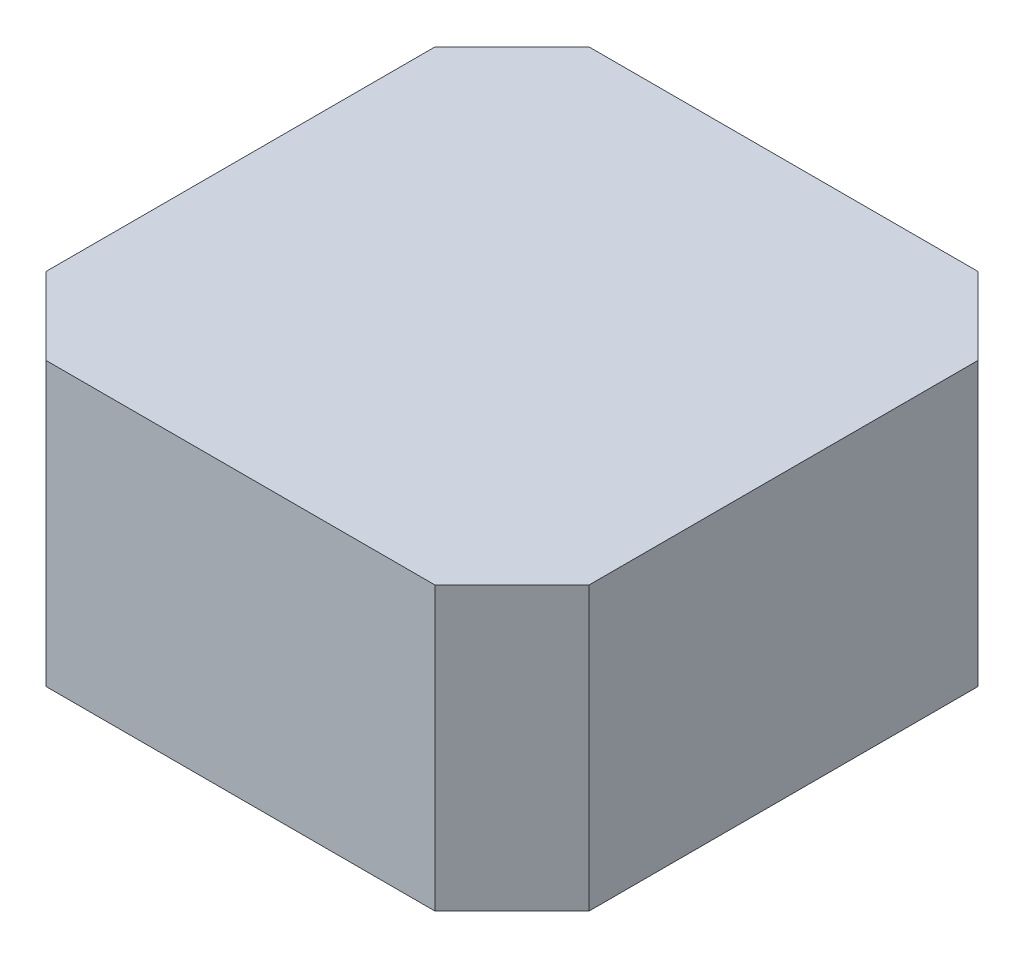
ISO-10303-21;
HEADER;
FILE_DESCRIPTION(('STEP AP214'),'2;1');
FILE_NAME('part.step','',(''),(''),'','','');
FILE_SCHEMA(('AUTOMOTIVE_DESIGN { 1 0 10303 214 1 1 1 1 }'));
ENDSEC;
DATA;
#1=APPLICATION_CONTEXT('core data for automotive mechanical design processes');
#2=APPLICATION_PROTOCOL_DEFINITION('international standard','automotive_design',2000,#1);
#3=PRODUCT_CONTEXT('',#1,'mechanical');
#4=PRODUCT('Part','Part','',(#3));
#5=PRODUCT_RELATED_PRODUCT_CATEGORY('part','',(#4));
#6=PRODUCT_DEFINITION_FORMATION('','',#4);
#7=PRODUCT_DEFINITION_CONTEXT('part definition',#1,'design');
#8=PRODUCT_DEFINITION('design','',#6,#7);
#9=PRODUCT_DEFINITION_SHAPE('','',#8);
#10=(LENGTH_UNIT() NAMED_UNIT(*) SI_UNIT(.MILLI.,.METRE.));
#11=(NAMED_UNIT(*) PLANE_ANGLE_UNIT() SI_UNIT($,.RADIAN.));
#12=(NAMED_UNIT(*) SI_UNIT($,.STERADIAN.) SOLID_ANGLE_UNIT());
#13=UNCERTAINTY_MEASURE_WITH_UNIT(LENGTH_MEASURE(1.E-05),#10,'distance_accuracy_value','');
#14=(GEOMETRIC_REPRESENTATION_CONTEXT(3) GLOBAL_UNCERTAINTY_ASSIGNED_CONTEXT((#13)) GLOBAL_UNIT_ASSIGNED_CONTEXT((#10,
#11,#12)) REPRESENTATION_CONTEXT('',''));
#15=CARTESIAN_POINT('',(0.,0.,0.));
#16=DIRECTION('',(0.,0.,1.));
#17=DIRECTION('',(1.,0.,0.));
#18=AXIS2_PLACEMENT_3D('',#15,#16,#17);
#19=CARTESIAN_POINT('',(0.,31.,0.));
#20=DIRECTION('',(0.,-1.,0.));
#21=DIRECTION('',(0.,0.,-1.));
#22=AXIS2_PLACEMENT_3D('',#19,#20,#21);
#23=PLANE('',#22);
#24=DIRECTION('',(0.707106781186548,0.,-0.707106781186548));
#25=VECTOR('',#24,1.);
#26=CARTESIAN_POINT('',(16.65,31.,19.65));
#27=LINE('',#26,#25);
#28=CARTESIAN_POINT('',(15.15,31.,21.15));
#29=VERTEX_POINT('',#28);
#30=CARTESIAN_POINT('',(21.15,31.,15.15));
#31=VERTEX_POINT('',#30);
#32=EDGE_CURVE('E144',#29,#31,#27,.T.);
#33=ORIENTED_EDGE('',*,*,#32,.T.);
#34=DIRECTION('',(0.,0.,-1.));
#35=VECTOR('',#34,1.);
#36=CARTESIAN_POINT('',(21.15,31.,7.575));
#37=LINE('',#36,#35);
#38=CARTESIAN_POINT('',(21.15,31.,-15.15));
#39=VERTEX_POINT('',#38);
#40=EDGE_CURVE('E138',#31,#39,#37,.T.);
#41=ORIENTED_EDGE('',*,*,#40,.T.);
#42=DIRECTION('',(-0.707106781186548,0.,-0.707106781186548));
#43=VECTOR('',#42,1.);
#44=CARTESIAN_POINT('',(19.65,31.,-16.65));
#45=LINE('',#44,#43);
#46=CARTESIAN_POINT('',(15.15,31.,-21.15));
#47=VERTEX_POINT('',#46);
#48=EDGE_CURVE('E119',#39,#47,#45,.T.);
#49=ORIENTED_EDGE('',*,*,#48,.T.);
#50=DIRECTION('',(-1.,0.,0.));
#51=VECTOR('',#50,1.);
#52=CARTESIAN_POINT('',(7.575,31.,-21.15));
#53=LINE('',#52,#51);
#54=CARTESIAN_POINT('',(-15.15,31.,-21.15));
#55=VERTEX_POINT('',#54);
#56=EDGE_CURVE('E115',#47,#55,#53,.T.);
#57=ORIENTED_EDGE('',*,*,#56,.T.);
#58=DIRECTION('',(-0.707106781186548,0.,0.707106781186548));
#59=VECTOR('',#58,1.);
#60=CARTESIAN_POINT('',(-16.65,31.,-19.65));
#61=LINE('',#60,#59);
#62=CARTESIAN_POINT('',(-21.15,31.,-15.15));
#63=VERTEX_POINT('',#62);
#64=EDGE_CURVE('E20',#55,#63,#61,.T.);
#65=ORIENTED_EDGE('',*,*,#64,.T.);
#66=DIRECTION('',(0.,0.,1.));
#67=VECTOR('',#66,1.);
#68=CARTESIAN_POINT('',(-21.15,31.,-7.575));
#69=LINE('',#68,#67);
#70=CARTESIAN_POINT('',(-21.15,31.,15.15));
#71=VERTEX_POINT('',#70);
#72=EDGE_CURVE('E85',#63,#71,#69,.T.);
#73=ORIENTED_EDGE('',*,*,#72,.T.);
#74=DIRECTION('',(0.707106781186548,0.,0.707106781186548));
#75=VECTOR('',#74,1.);
#76=CARTESIAN_POINT('',(-19.65,31.,16.65));
#77=LINE('',#76,#75);
#78=CARTESIAN_POINT('',(-15.15,31.,21.15));
#79=VERTEX_POINT('',#78);
#80=EDGE_CURVE('E139',#71,#79,#77,.T.);
#81=ORIENTED_EDGE('',*,*,#80,.T.);
#82=DIRECTION('',(1.,0.,0.));
#83=VECTOR('',#82,1.);
#84=CARTESIAN_POINT('',(-7.575,31.,21.15));
#85=LINE('',#84,#83);
#86=EDGE_CURVE('E163',#79,#29,#85,.T.);
#87=ORIENTED_EDGE('',*,*,#86,.T.);
#88=EDGE_LOOP('',(#33,#41,#49,#57,#65,#73,#81,#87));
#89=FACE_BOUND('',#88,.T.);
#90=ADVANCED_FACE('F16',(#89),#23,.F.);
#91=CARTESIAN_POINT('',(0.,9.,0.));
#92=DIRECTION('',(0.,1.,0.));
#93=DIRECTION('',(1.,0.,0.));
#94=AXIS2_PLACEMENT_3D('',#91,#92,#93);
#95=PLANE('',#94);
#96=DIRECTION('',(0.,0.,1.));
#97=VECTOR('',#96,1.);
#98=CARTESIAN_POINT('',(21.15,9.,7.575));
#99=LINE('',#98,#97);
#100=CARTESIAN_POINT('',(21.15,9.,-15.15));
#101=VERTEX_POINT('',#100);
#102=CARTESIAN_POINT('',(21.15,9.,15.15));
#103=VERTEX_POINT('',#102);
#104=EDGE_CURVE('E137',#101,#103,#99,.T.);
#105=ORIENTED_EDGE('',*,*,#104,.T.);
#106=DIRECTION('',(-0.707106781186548,0.,0.707106781186548));
#107=VECTOR('',#106,1.);
#108=CARTESIAN_POINT('',(16.65,9.,19.65));
#109=LINE('',#108,#107);
#110=CARTESIAN_POINT('',(15.15,9.,21.15));
#111=VERTEX_POINT('',#110);
#112=EDGE_CURVE('E150',#103,#111,#109,.T.);
#113=ORIENTED_EDGE('',*,*,#112,.T.);
#114=DIRECTION('',(-1.,0.,0.));
#115=VECTOR('',#114,1.);
#116=CARTESIAN_POINT('',(-7.575,9.,21.15));
#117=LINE('',#116,#115);
#118=CARTESIAN_POINT('',(-15.15,9.,21.15));
#119=VERTEX_POINT('',#118);
#120=EDGE_CURVE('E143',#111,#119,#117,.T.);
#121=ORIENTED_EDGE('',*,*,#120,.T.);
#122=DIRECTION('',(-0.707106781186548,0.,-0.707106781186548));
#123=VECTOR('',#122,1.);
#124=CARTESIAN_POINT('',(-19.65,9.,16.65));
#125=LINE('',#124,#123);
#126=CARTESIAN_POINT('',(-21.15,9.,15.15));
#127=VERTEX_POINT('',#126);
#128=EDGE_CURVE('E173',#119,#127,#125,.T.);
#129=ORIENTED_EDGE('',*,*,#128,.T.);
#130=DIRECTION('',(0.,0.,-1.));
#131=VECTOR('',#130,1.);
#132=CARTESIAN_POINT('',(-21.15,9.,-7.575));
#133=LINE('',#132,#131);
#134=CARTESIAN_POINT('',(-21.15,9.,-15.15));
#135=VERTEX_POINT('',#134);
#136=EDGE_CURVE('E77',#127,#135,#133,.T.);
#137=ORIENTED_EDGE('',*,*,#136,.T.);
#138=DIRECTION('',(0.707106781186548,0.,-0.707106781186548));
#139=VECTOR('',#138,1.);
#140=CARTESIAN_POINT('',(-16.65,9.,-19.65));
#141=LINE('',#140,#139);
#142=CARTESIAN_POINT('',(-15.15,9.,-21.15));
#143=VERTEX_POINT('',#142);
#144=EDGE_CURVE('E11',#135,#143,#141,.T.);
#145=ORIENTED_EDGE('',*,*,#144,.T.);
#146=DIRECTION('',(1.,0.,0.));
#147=VECTOR('',#146,1.);
#148=CARTESIAN_POINT('',(7.575,9.,-21.15));
#149=LINE('',#148,#147);
#150=CARTESIAN_POINT('',(15.15,9.,-21.15));
#151=VERTEX_POINT('',#150);
#152=EDGE_CURVE('E117',#143,#151,#149,.T.);
#153=ORIENTED_EDGE('',*,*,#152,.T.);
#154=DIRECTION('',(0.707106781186548,0.,0.707106781186548));
#155=VECTOR('',#154,1.);
#156=CARTESIAN_POINT('',(19.65,9.,-16.65));
#157=LINE('',#156,#155);
#158=EDGE_CURVE('E154',#151,#101,#157,.T.);
#159=ORIENTED_EDGE('',*,*,#158,.T.);
#160=EDGE_LOOP('',(#105,#113,#121,#129,#137,#145,#153,#159));
#161=FACE_BOUND('',#160,.T.);
#162=ADVANCED_FACE('F200',(#161),#95,.F.);
#163=CARTESIAN_POINT('',(-15.15,9.,-21.15));
#164=DIRECTION('',(-0.707106781186548,0.,-0.707106781186548));
#165=DIRECTION('',(-0.707106781186548,0.,0.707106781186548));
#166=AXIS2_PLACEMENT_3D('',#163,#164,#165);
#167=PLANE('',#166);
#168=ORIENTED_EDGE('',*,*,#64,.F.);
#169=DIRECTION('',(0.,1.,0.));
#170=VECTOR('',#169,1.);
#171=CARTESIAN_POINT('',(-15.15,9.,-21.15));
#172=LINE('',#171,#170);
#173=EDGE_CURVE('E106',#143,#55,#172,.T.);
#174=ORIENTED_EDGE('',*,*,#173,.F.);
#175=ORIENTED_EDGE('',*,*,#144,.F.);
#176=DIRECTION('',(0.,1.,0.));
#177=VECTOR('',#176,1.);
#178=CARTESIAN_POINT('',(-21.15,9.,-15.15));
#179=LINE('',#178,#177);
#180=EDGE_CURVE('E108',#135,#63,#179,.T.);
#181=ORIENTED_EDGE('',*,*,#180,.T.);
#182=EDGE_LOOP('',(#168,#174,#175,#181));
#183=FACE_BOUND('',#182,.T.);
#184=ADVANCED_FACE('F105',(#183),#167,.T.);
#185=CARTESIAN_POINT('',(-21.15,9.,-15.15));
#186=DIRECTION('',(-1.,0.,0.));
#187=DIRECTION('',(0.,0.,1.));
#188=AXIS2_PLACEMENT_3D('',#185,#186,#187);
#189=PLANE('',#188);
#190=ORIENTED_EDGE('',*,*,#72,.F.);
#191=ORIENTED_EDGE('',*,*,#180,.F.);
#192=ORIENTED_EDGE('',*,*,#136,.F.);
#193=DIRECTION('',(0.,1.,0.));
#194=VECTOR('',#193,1.);
#195=CARTESIAN_POINT('',(-21.15,9.,15.15));
#196=LINE('',#195,#194);
#197=EDGE_CURVE('E142',#127,#71,#196,.T.);
#198=ORIENTED_EDGE('',*,*,#197,.T.);
#199=EDGE_LOOP('',(#190,#191,#192,#198));
#200=FACE_BOUND('',#199,.T.);
#201=ADVANCED_FACE('F217',(#200),#189,.T.);
#202=CARTESIAN_POINT('',(-21.15,9.,15.15));
#203=DIRECTION('',(-0.707106781186548,0.,0.707106781186548));
#204=DIRECTION('',(0.,1.,0.));
#205=AXIS2_PLACEMENT_3D('',#202,#203,#204);
#206=PLANE('',#205);
#207=ORIENTED_EDGE('',*,*,#80,.F.);
#208=ORIENTED_EDGE('',*,*,#197,.F.);
#209=ORIENTED_EDGE('',*,*,#128,.F.);
#210=DIRECTION('',(0.,1.,0.));
#211=VECTOR('',#210,1.);
#212=CARTESIAN_POINT('',(-15.15,9.,21.15));
#213=LINE('',#212,#211);
#214=EDGE_CURVE('E166',#119,#79,#213,.T.);
#215=ORIENTED_EDGE('',*,*,#214,.T.);
#216=EDGE_LOOP('',(#207,#208,#209,#215));
#217=FACE_BOUND('',#216,.T.);
#218=ADVANCED_FACE('F207',(#217),#206,.T.);
#219=CARTESIAN_POINT('',(-15.15,9.,21.15));
#220=DIRECTION('',(0.,0.,1.));
#221=DIRECTION('',(1.,0.,0.));
#222=AXIS2_PLACEMENT_3D('',#219,#220,#221);
#223=PLANE('',#222);
#224=ORIENTED_EDGE('',*,*,#86,.F.);
#225=ORIENTED_EDGE('',*,*,#214,.F.);
#226=ORIENTED_EDGE('',*,*,#120,.F.);
#227=DIRECTION('',(0.,1.,0.));
#228=VECTOR('',#227,1.);
#229=CARTESIAN_POINT('',(15.15,9.,21.15));
#230=LINE('',#229,#228);
#231=EDGE_CURVE('E146',#111,#29,#230,.T.);
#232=ORIENTED_EDGE('',*,*,#231,.T.);
#233=EDGE_LOOP('',(#224,#225,#226,#232));
#234=FACE_BOUND('',#233,.T.);
#235=ADVANCED_FACE('F205',(#234),#223,.T.);
#236=CARTESIAN_POINT('',(15.15,9.,21.15));
#237=DIRECTION('',(0.707106781186548,0.,0.707106781186548));
#238=DIRECTION('',(0.,-1.,0.));
#239=AXIS2_PLACEMENT_3D('',#236,#237,#238);
#240=PLANE('',#239);
#241=ORIENTED_EDGE('',*,*,#32,.F.);
#242=ORIENTED_EDGE('',*,*,#231,.F.);
#243=ORIENTED_EDGE('',*,*,#112,.F.);
#244=DIRECTION('',(0.,1.,0.));
#245=VECTOR('',#244,1.);
#246=CARTESIAN_POINT('',(21.15,9.,15.15));
#247=LINE('',#246,#245);
#248=EDGE_CURVE('E133',#103,#31,#247,.T.);
#249=ORIENTED_EDGE('',*,*,#248,.T.);
#250=EDGE_LOOP('',(#241,#242,#243,#249));
#251=FACE_BOUND('',#250,.T.);
#252=ADVANCED_FACE('F210',(#251),#240,.T.);
#253=CARTESIAN_POINT('',(21.15,9.,15.15));
#254=DIRECTION('',(1.,0.,0.));
#255=DIRECTION('',(0.,1.,0.));
#256=AXIS2_PLACEMENT_3D('',#253,#254,#255);
#257=PLANE('',#256);
#258=ORIENTED_EDGE('',*,*,#40,.F.);
#259=ORIENTED_EDGE('',*,*,#248,.F.);
#260=ORIENTED_EDGE('',*,*,#104,.F.);
#261=DIRECTION('',(0.,1.,0.));
#262=VECTOR('',#261,1.);
#263=CARTESIAN_POINT('',(21.15,9.,-15.15));
#264=LINE('',#263,#262);
#265=EDGE_CURVE('E162',#101,#39,#264,.T.);
#266=ORIENTED_EDGE('',*,*,#265,.T.);
#267=EDGE_LOOP('',(#258,#259,#260,#266));
#268=FACE_BOUND('',#267,.T.);
#269=ADVANCED_FACE('F18',(#268),#257,.T.);
#270=CARTESIAN_POINT('',(21.15,9.,-15.15));
#271=DIRECTION('',(0.707106781186548,0.,-0.707106781186548));
#272=DIRECTION('',(0.,-1.,0.));
#273=AXIS2_PLACEMENT_3D('',#270,#271,#272);
#274=PLANE('',#273);
#275=ORIENTED_EDGE('',*,*,#48,.F.);
#276=ORIENTED_EDGE('',*,*,#265,.F.);
#277=ORIENTED_EDGE('',*,*,#158,.F.);
#278=DIRECTION('',(0.,1.,0.));
#279=VECTOR('',#278,1.);
#280=CARTESIAN_POINT('',(15.15,9.,-21.15));
#281=LINE('',#280,#279);
#282=EDGE_CURVE('E124',#151,#47,#281,.T.);
#283=ORIENTED_EDGE('',*,*,#282,.T.);
#284=EDGE_LOOP('',(#275,#276,#277,#283));
#285=FACE_BOUND('',#284,.T.);
#286=ADVANCED_FACE('F216',(#285),#274,.T.);
#287=CARTESIAN_POINT('',(15.15,9.,-21.15));
#288=DIRECTION('',(0.,0.,-1.));
#289=DIRECTION('',(0.,-1.,0.));
#290=AXIS2_PLACEMENT_3D('',#287,#288,#289);
#291=PLANE('',#290);
#292=ORIENTED_EDGE('',*,*,#56,.F.);
#293=ORIENTED_EDGE('',*,*,#282,.F.);
#294=ORIENTED_EDGE('',*,*,#152,.F.);
#295=ORIENTED_EDGE('',*,*,#173,.T.);
#296=EDGE_LOOP('',(#292,#293,#294,#295));
#297=FACE_BOUND('',#296,.T.);
#298=ADVANCED_FACE('F113',(#297),#291,.T.);
#299=CLOSED_SHELL('',(#90,#162,#184,#201,#218,#235,#252,#269,#286,#298));
#300=MANIFOLD_SOLID_BREP('B1',#299);
#301=ADVANCED_BREP_SHAPE_REPRESENTATION('',(#18,#300),#14);
#302=SHAPE_DEFINITION_REPRESENTATION(#9,#301);
ENDSEC;
END-ISO-10303-21;
